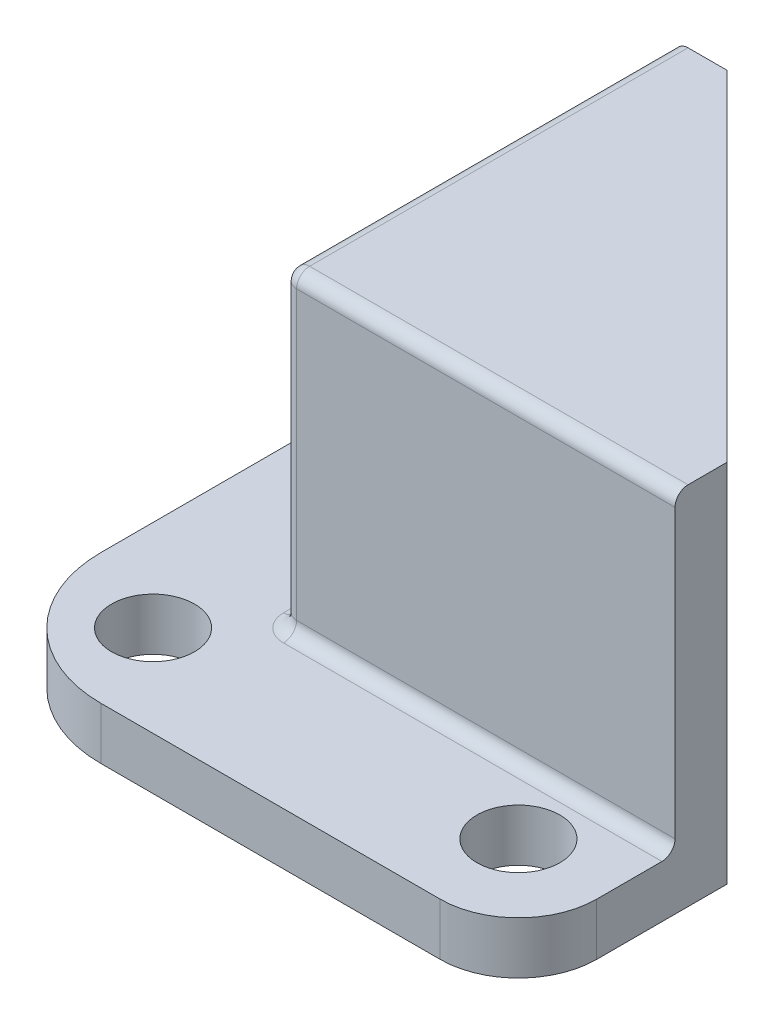
ISO-10303-21;
HEADER;
FILE_DESCRIPTION(('STEP AP214'),'2;1');
FILE_NAME('part.step','',(''),(''),'','','');
FILE_SCHEMA(('AUTOMOTIVE_DESIGN { 1 0 10303 214 1 1 1 1 }'));
ENDSEC;
DATA;
#1=APPLICATION_CONTEXT('core data for automotive mechanical design processes');
#2=APPLICATION_PROTOCOL_DEFINITION('international standard','automotive_design',2000,#1);
#3=PRODUCT_CONTEXT('',#1,'mechanical');
#4=PRODUCT('Part','Part','',(#3));
#5=PRODUCT_RELATED_PRODUCT_CATEGORY('part','',(#4));
#6=PRODUCT_DEFINITION_FORMATION('','',#4);
#7=PRODUCT_DEFINITION_CONTEXT('part definition',#1,'design');
#8=PRODUCT_DEFINITION('design','',#6,#7);
#9=PRODUCT_DEFINITION_SHAPE('','',#8);
#10=(LENGTH_UNIT() NAMED_UNIT(*) SI_UNIT(.MILLI.,.METRE.));
#11=(NAMED_UNIT(*) PLANE_ANGLE_UNIT() SI_UNIT($,.RADIAN.));
#12=(NAMED_UNIT(*) SI_UNIT($,.STERADIAN.) SOLID_ANGLE_UNIT());
#13=UNCERTAINTY_MEASURE_WITH_UNIT(LENGTH_MEASURE(1.E-05),#10,'distance_accuracy_value','');
#14=(GEOMETRIC_REPRESENTATION_CONTEXT(3) GLOBAL_UNCERTAINTY_ASSIGNED_CONTEXT((#13)) GLOBAL_UNIT_ASSIGNED_CONTEXT((#10,
#11,#12)) REPRESENTATION_CONTEXT('',''));
#15=CARTESIAN_POINT('',(0.,0.,0.));
#16=DIRECTION('',(0.,0.,1.));
#17=DIRECTION('',(1.,0.,0.));
#18=AXIS2_PLACEMENT_3D('',#15,#16,#17);
#19=CARTESIAN_POINT('',(0.,12.,0.));
#20=DIRECTION('',(0.,0.,1.));
#21=DIRECTION('',(1.,0.,0.));
#22=AXIS2_PLACEMENT_3D('',#19,#20,#21);
#23=PLANE('',#22);
#24=DIRECTION('',(0.,-1.,0.));
#25=VECTOR('',#24,1.);
#26=CARTESIAN_POINT('',(0.5,12.,0.));
#27=LINE('',#26,#25);
#28=CARTESIAN_POINT('',(0.5,13.5,0.));
#29=VERTEX_POINT('',#28);
#30=CARTESIAN_POINT('',(0.5,2.5,0.));
#31=VERTEX_POINT('',#30);
#32=EDGE_CURVE('E280',#29,#31,#27,.T.);
#33=ORIENTED_EDGE('',*,*,#32,.T.);
#34=DIRECTION('',(-1.,0.,0.));
#35=VECTOR('',#34,1.);
#36=CARTESIAN_POINT('',(15.,2.5,0.));
#37=LINE('',#36,#35);
#38=CARTESIAN_POINT('',(15.,2.5,0.));
#39=VERTEX_POINT('',#38);
#40=EDGE_CURVE('E284',#31,#39,#37,.F.);
#41=ORIENTED_EDGE('',*,*,#40,.T.);
#42=DIRECTION('',(0.,-1.,0.));
#43=VECTOR('',#42,1.);
#44=CARTESIAN_POINT('',(15.,12.,0.));
#45=LINE('',#44,#43);
#46=CARTESIAN_POINT('',(15.,13.5,0.));
#47=VERTEX_POINT('',#46);
#48=EDGE_CURVE('E252',#47,#39,#45,.T.);
#49=ORIENTED_EDGE('',*,*,#48,.F.);
#50=DIRECTION('',(1.,0.,0.));
#51=VECTOR('',#50,1.);
#52=CARTESIAN_POINT('',(0.,13.5,0.));
#53=LINE('',#52,#51);
#54=EDGE_CURVE('E282',#47,#29,#53,.F.);
#55=ORIENTED_EDGE('',*,*,#54,.T.);
#56=EDGE_LOOP('',(#33,#41,#49,#55));
#57=FACE_BOUND('',#56,.T.);
#58=ADVANCED_FACE('F33',(#57),#23,.T.);
#59=CARTESIAN_POINT('',(15.,12.,0.));
#60=DIRECTION('',(1.,0.,0.));
#61=DIRECTION('',(0.,0.,-1.));
#62=AXIS2_PLACEMENT_3D('',#59,#60,#61);
#63=PLANE('',#62);
#64=DIRECTION('',(0.,0.,-1.));
#65=VECTOR('',#64,1.);
#66=CARTESIAN_POINT('',(15.,14.,0.));
#67=LINE('',#66,#65);
#68=CARTESIAN_POINT('',(15.,14.,-0.5));
#69=VERTEX_POINT('',#68);
#70=CARTESIAN_POINT('',(15.,14.,-2.));
#71=VERTEX_POINT('',#70);
#72=EDGE_CURVE('E152',#69,#71,#67,.T.);
#73=ORIENTED_EDGE('',*,*,#72,.F.);
#74=CARTESIAN_POINT('',(15.,13.5,-0.5));
#75=DIRECTION('',(1.,0.,0.));
#76=DIRECTION('',(0.,0.,-1.));
#77=AXIS2_PLACEMENT_3D('',#74,#75,#76);
#78=CIRCLE('',#77,0.5);
#79=EDGE_CURVE('E288',#69,#47,#78,.T.);
#80=ORIENTED_EDGE('',*,*,#79,.T.);
#81=ORIENTED_EDGE('',*,*,#48,.T.);
#82=CARTESIAN_POINT('',(15.,2.5,0.5));
#83=DIRECTION('',(1.,0.,0.));
#84=DIRECTION('',(0.,0.,-1.));
#85=AXIS2_PLACEMENT_3D('',#82,#83,#84);
#86=CIRCLE('',#85,0.5);
#87=CARTESIAN_POINT('',(15.,2.,0.5));
#88=VERTEX_POINT('',#87);
#89=EDGE_CURVE('E11',#39,#88,#86,.F.);
#90=ORIENTED_EDGE('',*,*,#89,.T.);
#91=DIRECTION('',(0.,0.,-1.));
#92=VECTOR('',#91,1.);
#93=CARTESIAN_POINT('',(15.,2.,0.));
#94=LINE('',#93,#92);
#95=CARTESIAN_POINT('',(15.,2.,2.99999999999998));
#96=VERTEX_POINT('',#95);
#97=EDGE_CURVE('E198',#96,#88,#94,.T.);
#98=ORIENTED_EDGE('',*,*,#97,.F.);
#99=DIRECTION('',(0.,-1.,0.));
#100=VECTOR('',#99,1.);
#101=CARTESIAN_POINT('',(15.,2.,2.99999999999998));
#102=LINE('',#101,#100);
#103=CARTESIAN_POINT('',(15.,0.,2.99999999999998));
#104=VERTEX_POINT('',#103);
#105=EDGE_CURVE('E201',#96,#104,#102,.T.);
#106=ORIENTED_EDGE('',*,*,#105,.T.);
#107=DIRECTION('',(0.,0.,1.));
#108=VECTOR('',#107,1.);
#109=CARTESIAN_POINT('',(15.,0.,0.));
#110=LINE('',#109,#108);
#111=CARTESIAN_POINT('',(15.,0.,-2.));
#112=VERTEX_POINT('',#111);
#113=EDGE_CURVE('E228',#112,#104,#110,.T.);
#114=ORIENTED_EDGE('',*,*,#113,.F.);
#115=DIRECTION('',(0.,-1.,0.));
#116=VECTOR('',#115,1.);
#117=CARTESIAN_POINT('',(15.,12.,-2.));
#118=LINE('',#117,#116);
#119=CARTESIAN_POINT('',(15.,12.,-2.));
#120=VERTEX_POINT('',#119);
#121=EDGE_CURVE('E166',#120,#112,#118,.T.);
#122=ORIENTED_EDGE('',*,*,#121,.F.);
#123=DIRECTION('',(0.,-1.,0.));
#124=VECTOR('',#123,1.);
#125=CARTESIAN_POINT('',(15.,14.,-2.));
#126=LINE('',#125,#124);
#127=EDGE_CURVE('E163',#71,#120,#126,.T.);
#128=ORIENTED_EDGE('',*,*,#127,.F.);
#129=EDGE_LOOP('',(#73,#80,#81,#90,#98,#106,#114,#122,#128));
#130=FACE_BOUND('',#129,.T.);
#131=ADVANCED_FACE('F164',(#130),#63,.T.);
#132=CARTESIAN_POINT('',(0.,12.,-2.));
#133=DIRECTION('',(0.,0.,-1.));
#134=DIRECTION('',(-1.,0.,0.));
#135=AXIS2_PLACEMENT_3D('',#132,#133,#134);
#136=PLANE('',#135);
#137=DIRECTION('',(1.,0.,0.));
#138=VECTOR('',#137,1.);
#139=CARTESIAN_POINT('',(0.,0.,-2.));
#140=LINE('',#139,#138);
#141=CARTESIAN_POINT('',(2.,0.,-2.));
#142=VERTEX_POINT('',#141);
#143=EDGE_CURVE('E237',#142,#112,#140,.T.);
#144=ORIENTED_EDGE('',*,*,#143,.F.);
#145=DIRECTION('',(0.,-1.,0.));
#146=VECTOR('',#145,1.);
#147=CARTESIAN_POINT('',(2.,12.,-2.));
#148=LINE('',#147,#146);
#149=CARTESIAN_POINT('',(2.,12.,-2.));
#150=VERTEX_POINT('',#149);
#151=EDGE_CURVE('E249',#150,#142,#148,.T.);
#152=ORIENTED_EDGE('',*,*,#151,.F.);
#153=DIRECTION('',(1.,0.,0.));
#154=VECTOR('',#153,1.);
#155=CARTESIAN_POINT('',(0.,12.,-2.));
#156=LINE('',#155,#154);
#157=EDGE_CURVE('E229',#150,#120,#156,.T.);
#158=ORIENTED_EDGE('',*,*,#157,.T.);
#159=ORIENTED_EDGE('',*,*,#121,.T.);
#160=EDGE_LOOP('',(#144,#152,#158,#159));
#161=FACE_BOUND('',#160,.T.);
#162=ADVANCED_FACE('F345',(#161),#136,.T.);
#163=CARTESIAN_POINT('',(2.,12.,0.));
#164=DIRECTION('',(1.,0.,0.));
#165=DIRECTION('',(0.,0.,-1.));
#166=AXIS2_PLACEMENT_3D('',#163,#164,#165);
#167=PLANE('',#166);
#168=DIRECTION('',(0.,0.,1.));
#169=VECTOR('',#168,1.);
#170=CARTESIAN_POINT('',(2.,0.,0.));
#171=LINE('',#170,#169);
#172=CARTESIAN_POINT('',(2.,0.,-15.));
#173=VERTEX_POINT('',#172);
#174=EDGE_CURVE('E240',#173,#142,#171,.T.);
#175=ORIENTED_EDGE('',*,*,#174,.F.);
#176=DIRECTION('',(0.,-1.,0.));
#177=VECTOR('',#176,1.);
#178=CARTESIAN_POINT('',(2.,12.,-15.));
#179=LINE('',#178,#177);
#180=CARTESIAN_POINT('',(2.,12.,-15.));
#181=VERTEX_POINT('',#180);
#182=EDGE_CURVE('E247',#181,#173,#179,.T.);
#183=ORIENTED_EDGE('',*,*,#182,.F.);
#184=DIRECTION('',(0.,0.,1.));
#185=VECTOR('',#184,1.);
#186=CARTESIAN_POINT('',(2.,12.,0.));
#187=LINE('',#186,#185);
#188=EDGE_CURVE('E231',#181,#150,#187,.T.);
#189=ORIENTED_EDGE('',*,*,#188,.T.);
#190=ORIENTED_EDGE('',*,*,#151,.T.);
#191=EDGE_LOOP('',(#175,#183,#189,#190));
#192=FACE_BOUND('',#191,.T.);
#193=ADVANCED_FACE('F353',(#192),#167,.T.);
#194=CARTESIAN_POINT('',(0.,12.,-15.));
#195=DIRECTION('',(0.,0.,-1.));
#196=DIRECTION('',(-1.,0.,0.));
#197=AXIS2_PLACEMENT_3D('',#194,#195,#196);
#198=PLANE('',#197);
#199=DIRECTION('',(0.,-1.,0.));
#200=VECTOR('',#199,1.);
#201=CARTESIAN_POINT('',(0.,12.,-15.));
#202=LINE('',#201,#200);
#203=CARTESIAN_POINT('',(0.,13.5,-15.));
#204=VERTEX_POINT('',#203);
#205=CARTESIAN_POINT('',(0.,2.5,-15.));
#206=VERTEX_POINT('',#205);
#207=EDGE_CURVE('E235',#204,#206,#202,.T.);
#208=ORIENTED_EDGE('',*,*,#207,.F.);
#209=CARTESIAN_POINT('',(0.5,13.5,-15.));
#210=DIRECTION('',(0.,0.,-1.));
#211=DIRECTION('',(-1.,0.,0.));
#212=AXIS2_PLACEMENT_3D('',#209,#210,#211);
#213=CIRCLE('',#212,0.5);
#214=CARTESIAN_POINT('',(0.5,14.,-15.));
#215=VERTEX_POINT('',#214);
#216=EDGE_CURVE('E290',#204,#215,#213,.T.);
#217=ORIENTED_EDGE('',*,*,#216,.T.);
#218=DIRECTION('',(-1.,0.,0.));
#219=VECTOR('',#218,1.);
#220=CARTESIAN_POINT('',(2.,14.,-15.));
#221=LINE('',#220,#219);
#222=CARTESIAN_POINT('',(2.,14.,-15.));
#223=VERTEX_POINT('',#222);
#224=EDGE_CURVE('E160',#223,#215,#221,.T.);
#225=ORIENTED_EDGE('',*,*,#224,.F.);
#226=DIRECTION('',(0.,-1.,0.));
#227=VECTOR('',#226,1.);
#228=CARTESIAN_POINT('',(2.,14.,-15.));
#229=LINE('',#228,#227);
#230=EDGE_CURVE('E172',#223,#181,#229,.T.);
#231=ORIENTED_EDGE('',*,*,#230,.T.);
#232=ORIENTED_EDGE('',*,*,#182,.T.);
#233=DIRECTION('',(1.,0.,0.));
#234=VECTOR('',#233,1.);
#235=CARTESIAN_POINT('',(0.,0.,-15.));
#236=LINE('',#235,#234);
#237=CARTESIAN_POINT('',(-2.99999999999998,0.,-15.));
#238=VERTEX_POINT('',#237);
#239=EDGE_CURVE('E232',#238,#173,#236,.T.);
#240=ORIENTED_EDGE('',*,*,#239,.F.);
#241=DIRECTION('',(0.,-1.,0.));
#242=VECTOR('',#241,1.);
#243=CARTESIAN_POINT('',(-2.99999999999998,2.,-15.));
#244=LINE('',#243,#242);
#245=CARTESIAN_POINT('',(-2.99999999999998,2.,-15.));
#246=VERTEX_POINT('',#245);
#247=EDGE_CURVE('E225',#246,#238,#244,.T.);
#248=ORIENTED_EDGE('',*,*,#247,.F.);
#249=DIRECTION('',(-1.,0.,0.));
#250=VECTOR('',#249,1.);
#251=CARTESIAN_POINT('',(0.,2.,-15.));
#252=LINE('',#251,#250);
#253=CARTESIAN_POINT('',(-0.5,2.,-15.));
#254=VERTEX_POINT('',#253);
#255=EDGE_CURVE('E184',#254,#246,#252,.T.);
#256=ORIENTED_EDGE('',*,*,#255,.F.);
#257=CARTESIAN_POINT('',(-0.5,2.5,-15.));
#258=DIRECTION('',(0.,0.,-1.));
#259=DIRECTION('',(-1.,0.,0.));
#260=AXIS2_PLACEMENT_3D('',#257,#258,#259);
#261=CIRCLE('',#260,0.5);
#262=EDGE_CURVE('E42',#254,#206,#261,.F.);
#263=ORIENTED_EDGE('',*,*,#262,.T.);
#264=EDGE_LOOP('',(#208,#217,#225,#231,#232,#240,#248,#256,#263));
#265=FACE_BOUND('',#264,.T.);
#266=ADVANCED_FACE('F351',(#265),#198,.T.);
#267=CARTESIAN_POINT('',(0.,12.,0.));
#268=DIRECTION('',(-1.,0.,0.));
#269=DIRECTION('',(0.,0.,1.));
#270=AXIS2_PLACEMENT_3D('',#267,#268,#269);
#271=PLANE('',#270);
#272=ORIENTED_EDGE('',*,*,#207,.T.);
#273=DIRECTION('',(0.,0.,-1.));
#274=VECTOR('',#273,1.);
#275=CARTESIAN_POINT('',(0.,2.5,0.));
#276=LINE('',#275,#274);
#277=CARTESIAN_POINT('',(0.,2.5,-0.5));
#278=VERTEX_POINT('',#277);
#279=EDGE_CURVE('E278',#206,#278,#276,.F.);
#280=ORIENTED_EDGE('',*,*,#279,.T.);
#281=DIRECTION('',(0.,-1.,0.));
#282=VECTOR('',#281,1.);
#283=CARTESIAN_POINT('',(0.,12.,-0.5));
#284=LINE('',#283,#282);
#285=CARTESIAN_POINT('',(0.,13.5,-0.5));
#286=VERTEX_POINT('',#285);
#287=EDGE_CURVE('E276',#278,#286,#284,.F.);
#288=ORIENTED_EDGE('',*,*,#287,.T.);
#289=DIRECTION('',(0.,0.,1.));
#290=VECTOR('',#289,1.);
#291=CARTESIAN_POINT('',(0.,13.5,0.));
#292=LINE('',#291,#290);
#293=EDGE_CURVE('E274',#286,#204,#292,.F.);
#294=ORIENTED_EDGE('',*,*,#293,.T.);
#295=EDGE_LOOP('',(#272,#280,#288,#294));
#296=FACE_BOUND('',#295,.T.);
#297=ADVANCED_FACE('F371',(#296),#271,.T.);
#298=CARTESIAN_POINT('',(0.,0.,0.));
#299=DIRECTION('',(0.,1.,0.));
#300=DIRECTION('',(0.,0.,1.));
#301=AXIS2_PLACEMENT_3D('',#298,#299,#300);
#302=PLANE('',#301);
#303=CARTESIAN_POINT('',(-2.5,0.,-11.5));
#304=DIRECTION('',(0.,1.,0.));
#305=DIRECTION('',(0.,0.,1.));
#306=AXIS2_PLACEMENT_3D('',#303,#304,#305);
#307=CIRCLE('',#306,1.5875);
#308=CARTESIAN_POINT('',(-2.5,0.,-9.9125));
#309=VERTEX_POINT('',#308);
#310=EDGE_CURVE('E259',#309,#309,#307,.F.);
#311=ORIENTED_EDGE('',*,*,#310,.F.);
#312=EDGE_LOOP('',(#311));
#313=FACE_BOUND('',#312,.T.);
#314=CARTESIAN_POINT('',(11.5,0.,2.5));
#315=DIRECTION('',(0.,1.,0.));
#316=DIRECTION('',(0.,0.,1.));
#317=AXIS2_PLACEMENT_3D('',#314,#315,#316);
#318=CIRCLE('',#317,1.5875);
#319=CARTESIAN_POINT('',(11.5,0.,4.0875));
#320=VERTEX_POINT('',#319);
#321=EDGE_CURVE('E263',#320,#320,#318,.F.);
#322=ORIENTED_EDGE('',*,*,#321,.F.);
#323=EDGE_LOOP('',(#322));
#324=FACE_BOUND('',#323,.T.);
#325=CARTESIAN_POINT('',(-2.5,0.,2.5));
#326=DIRECTION('',(0.,1.,0.));
#327=DIRECTION('',(0.,0.,1.));
#328=AXIS2_PLACEMENT_3D('',#325,#326,#327);
#329=CIRCLE('',#328,1.58750000000001);
#330=CARTESIAN_POINT('',(-2.5,0.,4.08750000000001));
#331=VERTEX_POINT('',#330);
#332=EDGE_CURVE('E182',#331,#331,#329,.F.);
#333=ORIENTED_EDGE('',*,*,#332,.F.);
#334=EDGE_LOOP('',(#333));
#335=FACE_BOUND('',#334,.T.);
#336=ORIENTED_EDGE('',*,*,#113,.T.);
#337=CARTESIAN_POINT('',(12.,0.,3.));
#338=DIRECTION('',(0.,1.,0.));
#339=DIRECTION('',(0.,0.,1.));
#340=AXIS2_PLACEMENT_3D('',#337,#338,#339);
#341=CIRCLE('',#340,3.);
#342=CARTESIAN_POINT('',(12.,0.,6.));
#343=VERTEX_POINT('',#342);
#344=EDGE_CURVE('E187',#343,#104,#341,.T.);
#345=ORIENTED_EDGE('',*,*,#344,.F.);
#346=DIRECTION('',(1.,0.,0.));
#347=VECTOR('',#346,1.);
#348=CARTESIAN_POINT('',(0.,0.,6.));
#349=LINE('',#348,#347);
#350=CARTESIAN_POINT('',(-0.999999999999963,0.,6.));
#351=VERTEX_POINT('',#350);
#352=EDGE_CURVE('E209',#351,#343,#349,.T.);
#353=ORIENTED_EDGE('',*,*,#352,.F.);
#354=CARTESIAN_POINT('',(-0.999999999999998,0.,1.));
#355=DIRECTION('',(0.,1.,0.));
#356=DIRECTION('',(0.,0.,1.));
#357=AXIS2_PLACEMENT_3D('',#354,#355,#356);
#358=CIRCLE('',#357,5.);
#359=CARTESIAN_POINT('',(-6.,0.,0.999999999999965));
#360=VERTEX_POINT('',#359);
#361=EDGE_CURVE('E206',#351,#360,#358,.F.);
#362=ORIENTED_EDGE('',*,*,#361,.T.);
#363=DIRECTION('',(0.,0.,1.));
#364=VECTOR('',#363,1.);
#365=CARTESIAN_POINT('',(-6.,0.,0.));
#366=LINE('',#365,#364);
#367=CARTESIAN_POINT('',(-6.,0.,-12.));
#368=VERTEX_POINT('',#367);
#369=EDGE_CURVE('E203',#368,#360,#366,.T.);
#370=ORIENTED_EDGE('',*,*,#369,.F.);
#371=CARTESIAN_POINT('',(-3.,0.,-12.));
#372=DIRECTION('',(0.,1.,0.));
#373=DIRECTION('',(0.,0.,1.));
#374=AXIS2_PLACEMENT_3D('',#371,#372,#373);
#375=CIRCLE('',#374,3.);
#376=EDGE_CURVE('E171',#238,#368,#375,.T.);
#377=ORIENTED_EDGE('',*,*,#376,.F.);
#378=ORIENTED_EDGE('',*,*,#239,.T.);
#379=ORIENTED_EDGE('',*,*,#174,.T.);
#380=ORIENTED_EDGE('',*,*,#143,.T.);
#381=EDGE_LOOP('',(#336,#345,#353,#362,#370,#377,#378,#379,#380));
#382=FACE_BOUND('',#381,.T.);
#383=ADVANCED_FACE('F341',(#313,#324,#335,#382),#302,.F.);
#384=CARTESIAN_POINT('',(-3.,2.,-12.));
#385=DIRECTION('',(0.,-1.,0.));
#386=DIRECTION('',(0.,0.,-1.));
#387=AXIS2_PLACEMENT_3D('',#384,#385,#386);
#388=CYLINDRICAL_SURFACE('',#387,3.);
#389=ORIENTED_EDGE('',*,*,#376,.T.);
#390=DIRECTION('',(0.,-1.,0.));
#391=VECTOR('',#390,1.);
#392=CARTESIAN_POINT('',(-6.,2.,-12.));
#393=LINE('',#392,#391);
#394=CARTESIAN_POINT('',(-6.,2.,-12.));
#395=VERTEX_POINT('',#394);
#396=EDGE_CURVE('E222',#395,#368,#393,.T.);
#397=ORIENTED_EDGE('',*,*,#396,.F.);
#398=CARTESIAN_POINT('',(-3.,2.,-12.));
#399=DIRECTION('',(0.,1.,0.));
#400=DIRECTION('',(0.,0.,1.));
#401=AXIS2_PLACEMENT_3D('',#398,#399,#400);
#402=CIRCLE('',#401,3.);
#403=EDGE_CURVE('E186',#246,#395,#402,.T.);
#404=ORIENTED_EDGE('',*,*,#403,.F.);
#405=ORIENTED_EDGE('',*,*,#247,.T.);
#406=EDGE_LOOP('',(#389,#397,#404,#405));
#407=FACE_BOUND('',#406,.T.);
#408=ADVANCED_FACE('F360',(#407),#388,.T.);
#409=CARTESIAN_POINT('',(-6.,2.,0.));
#410=DIRECTION('',(1.,0.,0.));
#411=DIRECTION('',(0.,0.,-1.));
#412=AXIS2_PLACEMENT_3D('',#409,#410,#411);
#413=PLANE('',#412);
#414=ORIENTED_EDGE('',*,*,#369,.T.);
#415=DIRECTION('',(0.,-1.,0.));
#416=VECTOR('',#415,1.);
#417=CARTESIAN_POINT('',(-6.,2.,0.999999999999965));
#418=LINE('',#417,#416);
#419=CARTESIAN_POINT('',(-6.,2.,0.999999999999965));
#420=VERTEX_POINT('',#419);
#421=EDGE_CURVE('E220',#420,#360,#418,.T.);
#422=ORIENTED_EDGE('',*,*,#421,.F.);
#423=DIRECTION('',(0.,0.,1.));
#424=VECTOR('',#423,1.);
#425=CARTESIAN_POINT('',(-6.,2.,0.));
#426=LINE('',#425,#424);
#427=EDGE_CURVE('E189',#395,#420,#426,.T.);
#428=ORIENTED_EDGE('',*,*,#427,.F.);
#429=ORIENTED_EDGE('',*,*,#396,.T.);
#430=EDGE_LOOP('',(#414,#422,#428,#429));
#431=FACE_BOUND('',#430,.T.);
#432=ADVANCED_FACE('F459',(#431),#413,.F.);
#433=CARTESIAN_POINT('',(-0.999999999999998,2.,1.));
#434=DIRECTION('',(0.,-1.,0.));
#435=DIRECTION('',(0.,0.,-1.));
#436=AXIS2_PLACEMENT_3D('',#433,#434,#435);
#437=CYLINDRICAL_SURFACE('',#436,5.);
#438=ORIENTED_EDGE('',*,*,#361,.F.);
#439=DIRECTION('',(0.,-1.,0.));
#440=VECTOR('',#439,1.);
#441=CARTESIAN_POINT('',(-0.999999999999963,2.,6.));
#442=LINE('',#441,#440);
#443=CARTESIAN_POINT('',(-0.999999999999963,2.,6.));
#444=VERTEX_POINT('',#443);
#445=EDGE_CURVE('E218',#444,#351,#442,.T.);
#446=ORIENTED_EDGE('',*,*,#445,.F.);
#447=CARTESIAN_POINT('',(-0.999999999999998,2.,1.));
#448=DIRECTION('',(0.,1.,0.));
#449=DIRECTION('',(0.,0.,1.));
#450=AXIS2_PLACEMENT_3D('',#447,#448,#449);
#451=CIRCLE('',#450,5.);
#452=EDGE_CURVE('E191',#444,#420,#451,.F.);
#453=ORIENTED_EDGE('',*,*,#452,.T.);
#454=ORIENTED_EDGE('',*,*,#421,.T.);
#455=EDGE_LOOP('',(#438,#446,#453,#454));
#456=FACE_BOUND('',#455,.T.);
#457=ADVANCED_FACE('F455',(#456),#437,.T.);
#458=CARTESIAN_POINT('',(0.,2.,6.));
#459=DIRECTION('',(0.,0.,-1.));
#460=DIRECTION('',(-1.,0.,0.));
#461=AXIS2_PLACEMENT_3D('',#458,#459,#460);
#462=PLANE('',#461);
#463=ORIENTED_EDGE('',*,*,#352,.T.);
#464=DIRECTION('',(0.,-1.,0.));
#465=VECTOR('',#464,1.);
#466=CARTESIAN_POINT('',(12.,2.,6.));
#467=LINE('',#466,#465);
#468=CARTESIAN_POINT('',(12.,2.,6.));
#469=VERTEX_POINT('',#468);
#470=EDGE_CURVE('E215',#469,#343,#467,.T.);
#471=ORIENTED_EDGE('',*,*,#470,.F.);
#472=DIRECTION('',(1.,0.,0.));
#473=VECTOR('',#472,1.);
#474=CARTESIAN_POINT('',(0.,2.,6.));
#475=LINE('',#474,#473);
#476=EDGE_CURVE('E194',#444,#469,#475,.T.);
#477=ORIENTED_EDGE('',*,*,#476,.F.);
#478=ORIENTED_EDGE('',*,*,#445,.T.);
#479=EDGE_LOOP('',(#463,#471,#477,#478));
#480=FACE_BOUND('',#479,.T.);
#481=ADVANCED_FACE('F450',(#480),#462,.F.);
#482=CARTESIAN_POINT('',(12.,2.,3.));
#483=DIRECTION('',(0.,-1.,0.));
#484=DIRECTION('',(0.,0.,-1.));
#485=AXIS2_PLACEMENT_3D('',#482,#483,#484);
#486=CYLINDRICAL_SURFACE('',#485,3.);
#487=ORIENTED_EDGE('',*,*,#344,.T.);
#488=ORIENTED_EDGE('',*,*,#105,.F.);
#489=CARTESIAN_POINT('',(12.,2.,3.));
#490=DIRECTION('',(0.,1.,0.));
#491=DIRECTION('',(0.,0.,1.));
#492=AXIS2_PLACEMENT_3D('',#489,#490,#491);
#493=CIRCLE('',#492,3.);
#494=EDGE_CURVE('E196',#469,#96,#493,.T.);
#495=ORIENTED_EDGE('',*,*,#494,.F.);
#496=ORIENTED_EDGE('',*,*,#470,.T.);
#497=EDGE_LOOP('',(#487,#488,#495,#496));
#498=FACE_BOUND('',#497,.T.);
#499=ADVANCED_FACE('F337',(#498),#486,.T.);
#500=CARTESIAN_POINT('',(0.,2.,0.));
#501=DIRECTION('',(0.,1.,0.));
#502=DIRECTION('',(0.,0.,1.));
#503=AXIS2_PLACEMENT_3D('',#500,#501,#502);
#504=PLANE('',#503);
#505=CARTESIAN_POINT('',(-2.5,2.,-11.5));
#506=DIRECTION('',(0.,1.,0.));
#507=DIRECTION('',(0.,0.,1.));
#508=AXIS2_PLACEMENT_3D('',#505,#506,#507);
#509=CIRCLE('',#508,1.5875);
#510=CARTESIAN_POINT('',(-2.5,2.,-9.9125));
#511=VERTEX_POINT('',#510);
#512=EDGE_CURVE('E264',#511,#511,#509,.F.);
#513=ORIENTED_EDGE('',*,*,#512,.T.);
#514=EDGE_LOOP('',(#513));
#515=FACE_BOUND('',#514,.T.);
#516=CARTESIAN_POINT('',(11.5,2.,2.5));
#517=DIRECTION('',(0.,1.,0.));
#518=DIRECTION('',(0.,0.,1.));
#519=AXIS2_PLACEMENT_3D('',#516,#517,#518);
#520=CIRCLE('',#519,1.5875);
#521=CARTESIAN_POINT('',(11.5,2.,4.0875));
#522=VERTEX_POINT('',#521);
#523=EDGE_CURVE('E260',#522,#522,#520,.F.);
#524=ORIENTED_EDGE('',*,*,#523,.T.);
#525=EDGE_LOOP('',(#524));
#526=FACE_BOUND('',#525,.T.);
#527=CARTESIAN_POINT('',(-2.5,2.,2.5));
#528=DIRECTION('',(0.,1.,0.));
#529=DIRECTION('',(0.,0.,1.));
#530=AXIS2_PLACEMENT_3D('',#527,#528,#529);
#531=CIRCLE('',#530,1.58750000000001);
#532=CARTESIAN_POINT('',(-2.5,2.,4.08750000000001));
#533=VERTEX_POINT('',#532);
#534=EDGE_CURVE('E256',#533,#533,#531,.F.);
#535=ORIENTED_EDGE('',*,*,#534,.T.);
#536=EDGE_LOOP('',(#535));
#537=FACE_BOUND('',#536,.T.);
#538=CARTESIAN_POINT('',(0.5,2.,-0.5));
#539=DIRECTION('',(0.,1.,0.));
#540=DIRECTION('',(0.,0.,1.));
#541=AXIS2_PLACEMENT_3D('',#538,#539,#540);
#542=CIRCLE('',#541,1.);
#543=CARTESIAN_POINT('',(-0.5,2.,-0.5));
#544=VERTEX_POINT('',#543);
#545=CARTESIAN_POINT('',(0.5,2.,0.5));
#546=VERTEX_POINT('',#545);
#547=EDGE_CURVE('E255',#544,#546,#542,.T.);
#548=ORIENTED_EDGE('',*,*,#547,.F.);
#549=DIRECTION('',(0.,0.,-1.));
#550=VECTOR('',#549,1.);
#551=CARTESIAN_POINT('',(-0.5,2.,-15.));
#552=LINE('',#551,#550);
#553=EDGE_CURVE('E271',#544,#254,#552,.T.);
#554=ORIENTED_EDGE('',*,*,#553,.T.);
#555=ORIENTED_EDGE('',*,*,#255,.T.);
#556=ORIENTED_EDGE('',*,*,#403,.T.);
#557=ORIENTED_EDGE('',*,*,#427,.T.);
#558=ORIENTED_EDGE('',*,*,#452,.F.);
#559=ORIENTED_EDGE('',*,*,#476,.T.);
#560=ORIENTED_EDGE('',*,*,#494,.T.);
#561=ORIENTED_EDGE('',*,*,#97,.T.);
#562=DIRECTION('',(-1.,0.,0.));
#563=VECTOR('',#562,1.);
#564=CARTESIAN_POINT('',(0.,2.,0.5));
#565=LINE('',#564,#563);
#566=EDGE_CURVE('E269',#88,#546,#565,.T.);
#567=ORIENTED_EDGE('',*,*,#566,.T.);
#568=EDGE_LOOP('',(#548,#554,#555,#556,#557,#558,#559,#560,#561,#567));
#569=FACE_BOUND('',#568,.T.);
#570=ADVANCED_FACE('F330',(#515,#526,#537,#569),#504,.T.);
#571=CARTESIAN_POINT('',(2.,14.,-15.));
#572=DIRECTION('',(-0.707106781186547,0.,0.707106781186547));
#573=DIRECTION('',(0.707106781186548,0.,0.707106781186548));
#574=AXIS2_PLACEMENT_3D('',#571,#572,#573);
#575=PLANE('',#574);
#576=DIRECTION('',(-0.707106781186547,0.,-0.707106781186547));
#577=VECTOR('',#576,1.);
#578=CARTESIAN_POINT('',(2.,12.,-15.));
#579=LINE('',#578,#577);
#580=EDGE_CURVE('E181',#120,#181,#579,.T.);
#581=ORIENTED_EDGE('',*,*,#580,.T.);
#582=ORIENTED_EDGE('',*,*,#230,.F.);
#583=DIRECTION('',(-0.707106781186547,0.,-0.707106781186547));
#584=VECTOR('',#583,1.);
#585=CARTESIAN_POINT('',(2.,14.,-15.));
#586=LINE('',#585,#584);
#587=EDGE_CURVE('E156',#71,#223,#586,.T.);
#588=ORIENTED_EDGE('',*,*,#587,.F.);
#589=ORIENTED_EDGE('',*,*,#127,.T.);
#590=EDGE_LOOP('',(#581,#582,#588,#589));
#591=FACE_BOUND('',#590,.T.);
#592=ADVANCED_FACE('F174',(#591),#575,.F.);
#593=CARTESIAN_POINT('',(0.,14.,0.));
#594=DIRECTION('',(0.,1.,0.));
#595=DIRECTION('',(0.,0.,1.));
#596=AXIS2_PLACEMENT_3D('',#593,#594,#595);
#597=PLANE('',#596);
#598=DIRECTION('',(0.,0.,1.));
#599=VECTOR('',#598,1.);
#600=CARTESIAN_POINT('',(0.5,14.,0.));
#601=LINE('',#600,#599);
#602=CARTESIAN_POINT('',(0.5,14.,-0.5));
#603=VERTEX_POINT('',#602);
#604=EDGE_CURVE('E50',#215,#603,#601,.T.);
#605=ORIENTED_EDGE('',*,*,#604,.T.);
#606=DIRECTION('',(1.,0.,0.));
#607=VECTOR('',#606,1.);
#608=CARTESIAN_POINT('',(0.,14.,-0.5));
#609=LINE('',#608,#607);
#610=EDGE_CURVE('E54',#603,#69,#609,.T.);
#611=ORIENTED_EDGE('',*,*,#610,.T.);
#612=ORIENTED_EDGE('',*,*,#72,.T.);
#613=ORIENTED_EDGE('',*,*,#587,.T.);
#614=ORIENTED_EDGE('',*,*,#224,.T.);
#615=EDGE_LOOP('',(#605,#611,#612,#613,#614));
#616=FACE_BOUND('',#615,.T.);
#617=ADVANCED_FACE('F154',(#616),#597,.T.);
#618=CARTESIAN_POINT('',(0.,12.,0.));
#619=DIRECTION('',(0.,1.,0.));
#620=DIRECTION('',(0.,0.,1.));
#621=AXIS2_PLACEMENT_3D('',#618,#619,#620);
#622=PLANE('',#621);
#623=ORIENTED_EDGE('',*,*,#157,.F.);
#624=ORIENTED_EDGE('',*,*,#188,.F.);
#625=ORIENTED_EDGE('',*,*,#580,.F.);
#626=EDGE_LOOP('',(#623,#624,#625));
#627=FACE_BOUND('',#626,.T.);
#628=ADVANCED_FACE('F347',(#627),#622,.F.);
#629=CARTESIAN_POINT('',(-2.5,12.,2.5));
#630=DIRECTION('',(0.,-1.,0.));
#631=DIRECTION('',(0.,0.,-1.));
#632=AXIS2_PLACEMENT_3D('',#629,#630,#631);
#633=CYLINDRICAL_SURFACE('',#632,1.58750000000001);
#634=ORIENTED_EDGE('',*,*,#534,.F.);
#635=EDGE_LOOP('',(#634));
#636=FACE_BOUND('',#635,.T.);
#637=ORIENTED_EDGE('',*,*,#332,.T.);
#638=EDGE_LOOP('',(#637));
#639=FACE_BOUND('',#638,.T.);
#640=ADVANCED_FACE('F388',(#636,#639),#633,.F.);
#641=CARTESIAN_POINT('',(11.5,12.,2.5));
#642=DIRECTION('',(0.,-1.,0.));
#643=DIRECTION('',(0.,0.,-1.));
#644=AXIS2_PLACEMENT_3D('',#641,#642,#643);
#645=CYLINDRICAL_SURFACE('',#644,1.5875);
#646=ORIENTED_EDGE('',*,*,#523,.F.);
#647=EDGE_LOOP('',(#646));
#648=FACE_BOUND('',#647,.T.);
#649=ORIENTED_EDGE('',*,*,#321,.T.);
#650=EDGE_LOOP('',(#649));
#651=FACE_BOUND('',#650,.T.);
#652=ADVANCED_FACE('F380',(#648,#651),#645,.F.);
#653=CARTESIAN_POINT('',(-2.5,12.,-11.5));
#654=DIRECTION('',(0.,-1.,0.));
#655=DIRECTION('',(0.,0.,-1.));
#656=AXIS2_PLACEMENT_3D('',#653,#654,#655);
#657=CYLINDRICAL_SURFACE('',#656,1.5875);
#658=ORIENTED_EDGE('',*,*,#512,.F.);
#659=EDGE_LOOP('',(#658));
#660=FACE_BOUND('',#659,.T.);
#661=ORIENTED_EDGE('',*,*,#310,.T.);
#662=EDGE_LOOP('',(#661));
#663=FACE_BOUND('',#662,.T.);
#664=ADVANCED_FACE('F396',(#660,#663),#657,.F.);
#665=CARTESIAN_POINT('',(0.5,13.5,0.));
#666=DIRECTION('',(0.,0.,1.));
#667=DIRECTION('',(1.,0.,0.));
#668=AXIS2_PLACEMENT_3D('',#665,#666,#667);
#669=CYLINDRICAL_SURFACE('',#668,0.5);
#670=ORIENTED_EDGE('',*,*,#216,.F.);
#671=ORIENTED_EDGE('',*,*,#293,.F.);
#672=CARTESIAN_POINT('',(0.5,13.5,-0.5));
#673=DIRECTION('',(0.,0.,1.));
#674=DIRECTION('',(1.,0.,0.));
#675=AXIS2_PLACEMENT_3D('',#672,#673,#674);
#676=CIRCLE('',#675,0.5);
#677=EDGE_CURVE('E37',#603,#286,#676,.T.);
#678=ORIENTED_EDGE('',*,*,#677,.F.);
#679=ORIENTED_EDGE('',*,*,#604,.F.);
#680=EDGE_LOOP('',(#670,#671,#678,#679));
#681=FACE_BOUND('',#680,.T.);
#682=ADVANCED_FACE('F35',(#681),#669,.T.);
#683=CARTESIAN_POINT('',(0.,13.5,-0.5));
#684=DIRECTION('',(1.,0.,0.));
#685=DIRECTION('',(0.,0.,-1.));
#686=AXIS2_PLACEMENT_3D('',#683,#684,#685);
#687=CYLINDRICAL_SURFACE('',#686,0.5);
#688=ORIENTED_EDGE('',*,*,#79,.F.);
#689=ORIENTED_EDGE('',*,*,#610,.F.);
#690=CARTESIAN_POINT('',(0.5,13.5,-0.5));
#691=DIRECTION('',(-1.,0.,0.));
#692=DIRECTION('',(0.,0.,1.));
#693=AXIS2_PLACEMENT_3D('',#690,#691,#692);
#694=CIRCLE('',#693,0.5);
#695=EDGE_CURVE('E304',#29,#603,#694,.T.);
#696=ORIENTED_EDGE('',*,*,#695,.F.);
#697=ORIENTED_EDGE('',*,*,#54,.F.);
#698=EDGE_LOOP('',(#688,#689,#696,#697));
#699=FACE_BOUND('',#698,.T.);
#700=ADVANCED_FACE('F422',(#699),#687,.T.);
#701=CARTESIAN_POINT('',(0.5,13.5,-0.5));
#702=DIRECTION('',(0.,0.,1.));
#703=DIRECTION('',(1.,0.,0.));
#704=AXIS2_PLACEMENT_3D('',#701,#702,#703);
#705=SPHERICAL_SURFACE('',#704,0.5);
#706=ORIENTED_EDGE('',*,*,#695,.T.);
#707=ORIENTED_EDGE('',*,*,#677,.T.);
#708=CARTESIAN_POINT('',(0.5,13.5,-0.5));
#709=DIRECTION('',(0.,1.,0.));
#710=DIRECTION('',(0.,0.,1.));
#711=AXIS2_PLACEMENT_3D('',#708,#709,#710);
#712=CIRCLE('',#711,0.5);
#713=EDGE_CURVE('E302',#29,#286,#712,.F.);
#714=ORIENTED_EDGE('',*,*,#713,.F.);
#715=EDGE_LOOP('',(#706,#707,#714));
#716=FACE_BOUND('',#715,.T.);
#717=ADVANCED_FACE('F311',(#716),#705,.T.);
#718=CARTESIAN_POINT('',(0.5,12.,-0.5));
#719=DIRECTION('',(0.,-1.,0.));
#720=DIRECTION('',(0.,0.,-1.));
#721=AXIS2_PLACEMENT_3D('',#718,#719,#720);
#722=CYLINDRICAL_SURFACE('',#721,0.5);
#723=ORIENTED_EDGE('',*,*,#713,.T.);
#724=ORIENTED_EDGE('',*,*,#287,.F.);
#725=CARTESIAN_POINT('',(0.5,2.5,-0.5));
#726=DIRECTION('',(0.,1.,0.));
#727=DIRECTION('',(0.,0.,1.));
#728=AXIS2_PLACEMENT_3D('',#725,#726,#727);
#729=CIRCLE('',#728,0.5);
#730=EDGE_CURVE('E299',#31,#278,#729,.F.);
#731=ORIENTED_EDGE('',*,*,#730,.F.);
#732=ORIENTED_EDGE('',*,*,#32,.F.);
#733=EDGE_LOOP('',(#723,#724,#731,#732));
#734=FACE_BOUND('',#733,.T.);
#735=ADVANCED_FACE('F317',(#734),#722,.T.);
#736=CARTESIAN_POINT('',(0.,2.5,0.5));
#737=DIRECTION('',(1.,0.,0.));
#738=DIRECTION('',(0.,0.,-1.));
#739=AXIS2_PLACEMENT_3D('',#736,#737,#738);
#740=CYLINDRICAL_SURFACE('',#739,0.5);
#741=ORIENTED_EDGE('',*,*,#89,.F.);
#742=ORIENTED_EDGE('',*,*,#40,.F.);
#743=CARTESIAN_POINT('',(0.5,2.5,0.5));
#744=DIRECTION('',(1.,0.,0.));
#745=DIRECTION('',(0.,0.,-1.));
#746=AXIS2_PLACEMENT_3D('',#743,#744,#745);
#747=CIRCLE('',#746,0.5);
#748=EDGE_CURVE('E296',#546,#31,#747,.T.);
#749=ORIENTED_EDGE('',*,*,#748,.F.);
#750=ORIENTED_EDGE('',*,*,#566,.F.);
#751=EDGE_LOOP('',(#741,#742,#749,#750));
#752=FACE_BOUND('',#751,.T.);
#753=ADVANCED_FACE('F326',(#752),#740,.F.);
#754=CARTESIAN_POINT('',(0.5,2.5,-0.5));
#755=DIRECTION('',(0.,1.,0.));
#756=DIRECTION('',(0.,0.,1.));
#757=AXIS2_PLACEMENT_3D('',#754,#755,#756);
#758=TOROIDAL_SURFACE('',#757,1.,0.5);
#759=ORIENTED_EDGE('',*,*,#748,.T.);
#760=ORIENTED_EDGE('',*,*,#730,.T.);
#761=CARTESIAN_POINT('',(-0.5,2.5,-0.5));
#762=DIRECTION('',(0.,0.,-1.));
#763=DIRECTION('',(-1.,0.,0.));
#764=AXIS2_PLACEMENT_3D('',#761,#762,#763);
#765=CIRCLE('',#764,0.5);
#766=EDGE_CURVE('E293',#544,#278,#765,.F.);
#767=ORIENTED_EDGE('',*,*,#766,.F.);
#768=ORIENTED_EDGE('',*,*,#547,.T.);
#769=EDGE_LOOP('',(#759,#760,#767,#768));
#770=FACE_BOUND('',#769,.T.);
#771=ADVANCED_FACE('F413',(#770),#758,.F.);
#772=CARTESIAN_POINT('',(-0.5,2.5,0.));
#773=DIRECTION('',(0.,0.,1.));
#774=DIRECTION('',(1.,0.,0.));
#775=AXIS2_PLACEMENT_3D('',#772,#773,#774);
#776=CYLINDRICAL_SURFACE('',#775,0.5);
#777=ORIENTED_EDGE('',*,*,#766,.T.);
#778=ORIENTED_EDGE('',*,*,#279,.F.);
#779=ORIENTED_EDGE('',*,*,#262,.F.);
#780=ORIENTED_EDGE('',*,*,#553,.F.);
#781=EDGE_LOOP('',(#777,#778,#779,#780));
#782=FACE_BOUND('',#781,.T.);
#783=ADVANCED_FACE('F367',(#782),#776,.F.);
#784=CLOSED_SHELL('',(#58,#131,#162,#193,#266,#297,#383,#408,#432,#457,#481,#499,#570,#592,#617,
#628,#640,#652,#664,#682,#700,#717,#735,#753,#771,#783));
#785=MANIFOLD_SOLID_BREP('B2',#784);
#786=ADVANCED_BREP_SHAPE_REPRESENTATION('',(#18,#785),#14);
#787=SHAPE_DEFINITION_REPRESENTATION(#9,#786);
ENDSEC;
END-ISO-10303-21;
